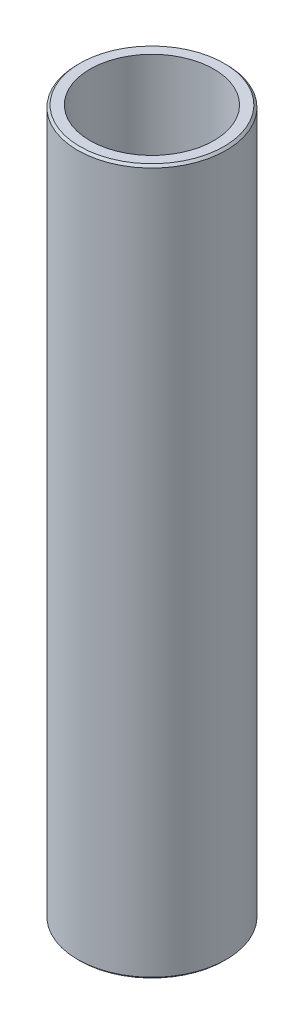
ISO-10303-21;
HEADER;
FILE_DESCRIPTION(('STEP AP214'),'2;1');
FILE_NAME('part.step','',(''),(''),'','','');
FILE_SCHEMA(('AUTOMOTIVE_DESIGN { 1 0 10303 214 1 1 1 1 }'));
ENDSEC;
DATA;
#1=APPLICATION_CONTEXT('core data for automotive mechanical design processes');
#2=APPLICATION_PROTOCOL_DEFINITION('international standard','automotive_design',2000,#1);
#3=PRODUCT_CONTEXT('',#1,'mechanical');
#4=PRODUCT('Part','Part','',(#3));
#5=PRODUCT_RELATED_PRODUCT_CATEGORY('part','',(#4));
#6=PRODUCT_DEFINITION_FORMATION('','',#4);
#7=PRODUCT_DEFINITION_CONTEXT('part definition',#1,'design');
#8=PRODUCT_DEFINITION('design','',#6,#7);
#9=PRODUCT_DEFINITION_SHAPE('','',#8);
#10=(LENGTH_UNIT() NAMED_UNIT(*) SI_UNIT(.MILLI.,.METRE.));
#11=(NAMED_UNIT(*) PLANE_ANGLE_UNIT() SI_UNIT($,.RADIAN.));
#12=(NAMED_UNIT(*) SI_UNIT($,.STERADIAN.) SOLID_ANGLE_UNIT());
#13=UNCERTAINTY_MEASURE_WITH_UNIT(LENGTH_MEASURE(1.E-05),#10,'distance_accuracy_value','');
#14=(GEOMETRIC_REPRESENTATION_CONTEXT(3) GLOBAL_UNCERTAINTY_ASSIGNED_CONTEXT((#13)) GLOBAL_UNIT_ASSIGNED_CONTEXT((#10,
#11,#12)) REPRESENTATION_CONTEXT('',''));
#15=CARTESIAN_POINT('',(0.,0.,0.));
#16=DIRECTION('',(0.,0.,1.));
#17=DIRECTION('',(1.,0.,0.));
#18=AXIS2_PLACEMENT_3D('',#15,#16,#17);
#19=CARTESIAN_POINT('',(0.,403.305592900726,0.));
#20=DIRECTION('',(0.,-1.,0.));
#21=DIRECTION('',(0.,0.,-1.));
#22=AXIS2_PLACEMENT_3D('',#19,#20,#21);
#23=CYLINDRICAL_SURFACE('',#22,42.5);
#24=CARTESIAN_POINT('',(0.,402.038893590387,0.));
#25=DIRECTION('',(0.,1.,0.));
#26=DIRECTION('',(0.,0.,1.));
#27=AXIS2_PLACEMENT_3D('',#24,#25,#26);
#28=CIRCLE('',#27,42.5);
#29=CARTESIAN_POINT('',(0.,402.038893590387,42.5));
#30=VERTEX_POINT('',#29);
#31=EDGE_CURVE('E50',#30,#30,#28,.F.);
#32=ORIENTED_EDGE('',*,*,#31,.T.);
#33=EDGE_LOOP('',(#32));
#34=FACE_BOUND('',#33,.T.);
#35=CARTESIAN_POINT('',(0.,1.26669931033901,0.));
#36=DIRECTION('',(0.,1.,0.));
#37=DIRECTION('',(0.,0.,1.));
#38=AXIS2_PLACEMENT_3D('',#35,#36,#37);
#39=CIRCLE('',#38,42.5);
#40=CARTESIAN_POINT('',(0.,1.26669931033901,42.5));
#41=VERTEX_POINT('',#40);
#42=EDGE_CURVE('E51',#41,#41,#39,.T.);
#43=ORIENTED_EDGE('',*,*,#42,.T.);
#44=EDGE_LOOP('',(#43));
#45=FACE_BOUND('',#44,.T.);
#46=ADVANCED_FACE('F39',(#34,#45),#23,.T.);
#47=CARTESIAN_POINT('',(0.,403.305592900726,0.));
#48=DIRECTION('',(0.,1.,0.));
#49=DIRECTION('',(0.,0.,1.));
#50=AXIS2_PLACEMENT_3D('',#47,#48,#49);
#51=PLANE('',#50);
#52=CARTESIAN_POINT('',(0.,403.305592900726,0.));
#53=DIRECTION('',(0.,1.,0.));
#54=DIRECTION('',(0.,0.,1.));
#55=AXIS2_PLACEMENT_3D('',#52,#53,#54);
#56=CIRCLE('',#55,41.233300689661);
#57=CARTESIAN_POINT('',(0.,403.305592900726,41.233300689661));
#58=VERTEX_POINT('',#57);
#59=EDGE_CURVE('E54',#58,#58,#56,.T.);
#60=ORIENTED_EDGE('',*,*,#59,.T.);
#61=EDGE_LOOP('',(#60));
#62=FACE_BOUND('',#61,.T.);
#63=CARTESIAN_POINT('',(0.,403.305592900726,0.));
#64=DIRECTION('',(0.,1.,0.));
#65=DIRECTION('',(0.,0.,1.));
#66=AXIS2_PLACEMENT_3D('',#63,#64,#65);
#67=CIRCLE('',#66,35.4422016545977);
#68=CARTESIAN_POINT('',(0.,403.305592900726,35.4422016545977));
#69=VERTEX_POINT('',#68);
#70=EDGE_CURVE('E58',#69,#69,#67,.T.);
#71=ORIENTED_EDGE('',*,*,#70,.F.);
#72=EDGE_LOOP('',(#71));
#73=FACE_BOUND('',#72,.T.);
#74=ADVANCED_FACE('F69',(#62,#73),#51,.T.);
#75=CARTESIAN_POINT('',(0.,0.,0.));
#76=DIRECTION('',(0.,1.,0.));
#77=DIRECTION('',(0.,0.,1.));
#78=AXIS2_PLACEMENT_3D('',#75,#76,#77);
#79=PLANE('',#78);
#80=CARTESIAN_POINT('',(0.,0.,0.));
#81=DIRECTION('',(0.,1.,0.));
#82=DIRECTION('',(0.,0.,1.));
#83=AXIS2_PLACEMENT_3D('',#80,#81,#82);
#84=CIRCLE('',#83,41.233300689661);
#85=CARTESIAN_POINT('',(0.,0.,41.233300689661));
#86=VERTEX_POINT('',#85);
#87=EDGE_CURVE('E10',#86,#86,#84,.F.);
#88=ORIENTED_EDGE('',*,*,#87,.T.);
#89=EDGE_LOOP('',(#88));
#90=FACE_BOUND('',#89,.T.);
#91=CARTESIAN_POINT('',(0.,0.,0.));
#92=DIRECTION('',(0.,1.,0.));
#93=DIRECTION('',(0.,0.,1.));
#94=AXIS2_PLACEMENT_3D('',#91,#92,#93);
#95=CIRCLE('',#94,35.4422016545977);
#96=CARTESIAN_POINT('',(0.,0.,35.4422016545977));
#97=VERTEX_POINT('',#96);
#98=EDGE_CURVE('E63',#97,#97,#95,.T.);
#99=ORIENTED_EDGE('',*,*,#98,.T.);
#100=EDGE_LOOP('',(#99));
#101=FACE_BOUND('',#100,.T.);
#102=ADVANCED_FACE('F75',(#90,#101),#79,.F.);
#103=CARTESIAN_POINT('',(0.,403.305592900726,0.));
#104=DIRECTION('',(0.,-1.,0.));
#105=DIRECTION('',(0.,0.,-1.));
#106=AXIS2_PLACEMENT_3D('',#103,#104,#105);
#107=CYLINDRICAL_SURFACE('',#106,35.4422016545977);
#108=ORIENTED_EDGE('',*,*,#70,.T.);
#109=EDGE_LOOP('',(#108));
#110=FACE_BOUND('',#109,.T.);
#111=ORIENTED_EDGE('',*,*,#98,.F.);
#112=EDGE_LOOP('',(#111));
#113=FACE_BOUND('',#112,.T.);
#114=ADVANCED_FACE('F70',(#110,#113),#107,.F.);
#115=CARTESIAN_POINT('',(0.,403.305592900726,0.));
#116=DIRECTION('',(0.,-1.,0.));
#117=DIRECTION('',(0.,0.,-1.));
#118=AXIS2_PLACEMENT_3D('',#115,#116,#117);
#119=CONICAL_SURFACE('',#118,41.233300689661,0.785398163397437);
#120=ORIENTED_EDGE('',*,*,#31,.F.);
#121=EDGE_LOOP('',(#120));
#122=FACE_BOUND('',#121,.T.);
#123=ORIENTED_EDGE('',*,*,#59,.F.);
#124=EDGE_LOOP('',(#123));
#125=FACE_BOUND('',#124,.T.);
#126=ADVANCED_FACE('F81',(#122,#125),#119,.T.);
#127=CARTESIAN_POINT('',(0.,1.26669931033901,0.));
#128=DIRECTION('',(0.,1.,0.));
#129=DIRECTION('',(0.,0.,1.));
#130=AXIS2_PLACEMENT_3D('',#127,#128,#129);
#131=CONICAL_SURFACE('',#130,42.5,0.785398163397459);
#132=ORIENTED_EDGE('',*,*,#87,.F.);
#133=EDGE_LOOP('',(#132));
#134=FACE_BOUND('',#133,.T.);
#135=ORIENTED_EDGE('',*,*,#42,.F.);
#136=EDGE_LOOP('',(#135));
#137=FACE_BOUND('',#136,.T.);
#138=ADVANCED_FACE('F45',(#134,#137),#131,.T.);
#139=CLOSED_SHELL('',(#46,#74,#102,#114,#126,#138));
#140=MANIFOLD_SOLID_BREP('B2',#139);
#141=ADVANCED_BREP_SHAPE_REPRESENTATION('',(#18,#140),#14);
#142=SHAPE_DEFINITION_REPRESENTATION(#9,#141);
ENDSEC;
END-ISO-10303-21;
